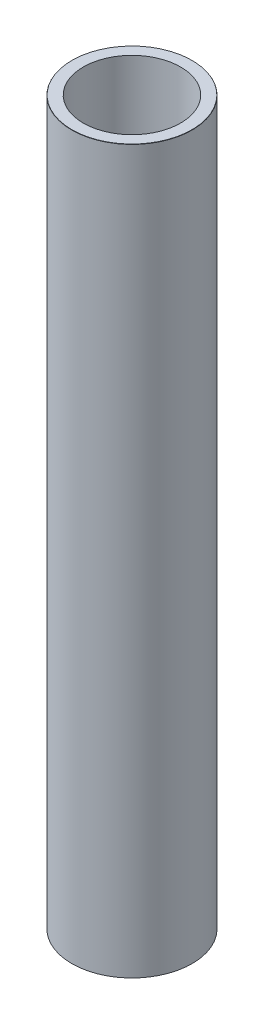
ISO-10303-21;
HEADER;
FILE_DESCRIPTION(('STEP AP214'),'2;1');
FILE_NAME('part.step','',(''),(''),'','','');
FILE_SCHEMA(('AUTOMOTIVE_DESIGN { 1 0 10303 214 1 1 1 1 }'));
ENDSEC;
DATA;
#1=APPLICATION_CONTEXT('core data for automotive mechanical design processes');
#2=APPLICATION_PROTOCOL_DEFINITION('international standard','automotive_design',2000,#1);
#3=PRODUCT_CONTEXT('',#1,'mechanical');
#4=PRODUCT('Part','Part','',(#3));
#5=PRODUCT_RELATED_PRODUCT_CATEGORY('part','',(#4));
#6=PRODUCT_DEFINITION_FORMATION('','',#4);
#7=PRODUCT_DEFINITION_CONTEXT('part definition',#1,'design');
#8=PRODUCT_DEFINITION('design','',#6,#7);
#9=PRODUCT_DEFINITION_SHAPE('','',#8);
#10=(LENGTH_UNIT() NAMED_UNIT(*) SI_UNIT(.MILLI.,.METRE.));
#11=(NAMED_UNIT(*) PLANE_ANGLE_UNIT() SI_UNIT($,.RADIAN.));
#12=(NAMED_UNIT(*) SI_UNIT($,.STERADIAN.) SOLID_ANGLE_UNIT());
#13=UNCERTAINTY_MEASURE_WITH_UNIT(LENGTH_MEASURE(1.E-05),#10,'distance_accuracy_value','');
#14=(GEOMETRIC_REPRESENTATION_CONTEXT(3) GLOBAL_UNCERTAINTY_ASSIGNED_CONTEXT((#13)) GLOBAL_UNIT_ASSIGNED_CONTEXT((#10,
#11,#12)) REPRESENTATION_CONTEXT('',''));
#15=CARTESIAN_POINT('',(0.,0.,0.));
#16=DIRECTION('',(0.,0.,1.));
#17=DIRECTION('',(1.,0.,0.));
#18=AXIS2_PLACEMENT_3D('',#15,#16,#17);
#19=CARTESIAN_POINT('',(0.,600.,0.));
#20=DIRECTION('',(0.,-1.,0.));
#21=DIRECTION('',(0.,0.,-1.));
#22=AXIS2_PLACEMENT_3D('',#19,#20,#21);
#23=CYLINDRICAL_SURFACE('',#22,50.);
#24=CARTESIAN_POINT('',(0.,599.79893082536,0.));
#25=DIRECTION('',(0.,1.,0.));
#26=DIRECTION('',(0.,0.,1.));
#27=AXIS2_PLACEMENT_3D('',#24,#25,#26);
#28=CIRCLE('',#27,50.);
#29=CARTESIAN_POINT('',(0.,599.79893082536,50.));
#30=VERTEX_POINT('',#29);
#31=EDGE_CURVE('E50',#30,#30,#28,.F.);
#32=ORIENTED_EDGE('',*,*,#31,.T.);
#33=EDGE_LOOP('',(#32));
#34=FACE_BOUND('',#33,.T.);
#35=CARTESIAN_POINT('',(0.,0.116087342104332,0.));
#36=DIRECTION('',(0.,1.,0.));
#37=DIRECTION('',(0.,0.,1.));
#38=AXIS2_PLACEMENT_3D('',#35,#36,#37);
#39=CIRCLE('',#38,50.);
#40=CARTESIAN_POINT('',(0.,0.116087342104332,50.));
#41=VERTEX_POINT('',#40);
#42=EDGE_CURVE('E51',#41,#41,#39,.T.);
#43=ORIENTED_EDGE('',*,*,#42,.T.);
#44=EDGE_LOOP('',(#43));
#45=FACE_BOUND('',#44,.T.);
#46=ADVANCED_FACE('F39',(#34,#45),#23,.T.);
#47=CARTESIAN_POINT('',(0.,600.,0.));
#48=DIRECTION('',(0.,1.,0.));
#49=DIRECTION('',(0.,0.,1.));
#50=AXIS2_PLACEMENT_3D('',#47,#48,#49);
#51=PLANE('',#50);
#52=CARTESIAN_POINT('',(0.,600.,0.));
#53=DIRECTION('',(0.,1.,0.));
#54=DIRECTION('',(0.,0.,1.));
#55=AXIS2_PLACEMENT_3D('',#52,#53,#54);
#56=CIRCLE('',#55,49.8839126578956);
#57=CARTESIAN_POINT('',(0.,600.,49.8839126578956));
#58=VERTEX_POINT('',#57);
#59=EDGE_CURVE('E54',#58,#58,#56,.T.);
#60=ORIENTED_EDGE('',*,*,#59,.T.);
#61=EDGE_LOOP('',(#60));
#62=FACE_BOUND('',#61,.T.);
#63=CARTESIAN_POINT('',(0.,600.,0.));
#64=DIRECTION('',(0.,1.,0.));
#65=DIRECTION('',(0.,0.,1.));
#66=AXIS2_PLACEMENT_3D('',#63,#64,#65);
#67=CIRCLE('',#66,40.4137729357456);
#68=CARTESIAN_POINT('',(0.,600.,40.4137729357456));
#69=VERTEX_POINT('',#68);
#70=EDGE_CURVE('E58',#69,#69,#67,.T.);
#71=ORIENTED_EDGE('',*,*,#70,.F.);
#72=EDGE_LOOP('',(#71));
#73=FACE_BOUND('',#72,.T.);
#74=ADVANCED_FACE('F69',(#62,#73),#51,.T.);
#75=CARTESIAN_POINT('',(0.,0.,0.));
#76=DIRECTION('',(0.,1.,0.));
#77=DIRECTION('',(0.,0.,1.));
#78=AXIS2_PLACEMENT_3D('',#75,#76,#77);
#79=PLANE('',#78);
#80=CARTESIAN_POINT('',(0.,0.,0.));
#81=DIRECTION('',(0.,1.,0.));
#82=DIRECTION('',(0.,0.,1.));
#83=AXIS2_PLACEMENT_3D('',#80,#81,#82);
#84=CIRCLE('',#83,49.7989308253597);
#85=CARTESIAN_POINT('',(0.,0.,49.7989308253597));
#86=VERTEX_POINT('',#85);
#87=EDGE_CURVE('E10',#86,#86,#84,.F.);
#88=ORIENTED_EDGE('',*,*,#87,.T.);
#89=EDGE_LOOP('',(#88));
#90=FACE_BOUND('',#89,.T.);
#91=CARTESIAN_POINT('',(0.,0.,0.));
#92=DIRECTION('',(0.,1.,0.));
#93=DIRECTION('',(0.,0.,1.));
#94=AXIS2_PLACEMENT_3D('',#91,#92,#93);
#95=CIRCLE('',#94,40.4137729357456);
#96=CARTESIAN_POINT('',(0.,0.,40.4137729357456));
#97=VERTEX_POINT('',#96);
#98=EDGE_CURVE('E63',#97,#97,#95,.T.);
#99=ORIENTED_EDGE('',*,*,#98,.T.);
#100=EDGE_LOOP('',(#99));
#101=FACE_BOUND('',#100,.T.);
#102=ADVANCED_FACE('F75',(#90,#101),#79,.F.);
#103=CARTESIAN_POINT('',(0.,600.,0.));
#104=DIRECTION('',(0.,-1.,0.));
#105=DIRECTION('',(0.,0.,-1.));
#106=AXIS2_PLACEMENT_3D('',#103,#104,#105);
#107=CYLINDRICAL_SURFACE('',#106,40.4137729357456);
#108=ORIENTED_EDGE('',*,*,#70,.T.);
#109=EDGE_LOOP('',(#108));
#110=FACE_BOUND('',#109,.T.);
#111=ORIENTED_EDGE('',*,*,#98,.F.);
#112=EDGE_LOOP('',(#111));
#113=FACE_BOUND('',#112,.T.);
#114=ADVANCED_FACE('F70',(#110,#113),#107,.F.);
#115=CARTESIAN_POINT('',(0.,600.,0.));
#116=DIRECTION('',(0.,-1.,0.));
#117=DIRECTION('',(0.,0.,-1.));
#118=AXIS2_PLACEMENT_3D('',#115,#116,#117);
#119=CONICAL_SURFACE('',#118,49.8839126578956,0.523598775598268);
#120=ORIENTED_EDGE('',*,*,#31,.F.);
#121=EDGE_LOOP('',(#120));
#122=FACE_BOUND('',#121,.T.);
#123=ORIENTED_EDGE('',*,*,#59,.F.);
#124=EDGE_LOOP('',(#123));
#125=FACE_BOUND('',#124,.T.);
#126=ADVANCED_FACE('F81',(#122,#125),#119,.T.);
#127=CARTESIAN_POINT('',(0.,0.116087342104332,0.));
#128=DIRECTION('',(0.,1.,0.));
#129=DIRECTION('',(0.,0.,1.));
#130=AXIS2_PLACEMENT_3D('',#127,#128,#129);
#131=CONICAL_SURFACE('',#130,50.,1.04719755119644);
#132=ORIENTED_EDGE('',*,*,#87,.F.);
#133=EDGE_LOOP('',(#132));
#134=FACE_BOUND('',#133,.T.);
#135=ORIENTED_EDGE('',*,*,#42,.F.);
#136=EDGE_LOOP('',(#135));
#137=FACE_BOUND('',#136,.T.);
#138=ADVANCED_FACE('F45',(#134,#137),#131,.T.);
#139=CLOSED_SHELL('',(#46,#74,#102,#114,#126,#138));
#140=MANIFOLD_SOLID_BREP('B2',#139);
#141=ADVANCED_BREP_SHAPE_REPRESENTATION('',(#18,#140),#14);
#142=SHAPE_DEFINITION_REPRESENTATION(#9,#141);
ENDSEC;
END-ISO-10303-21;
